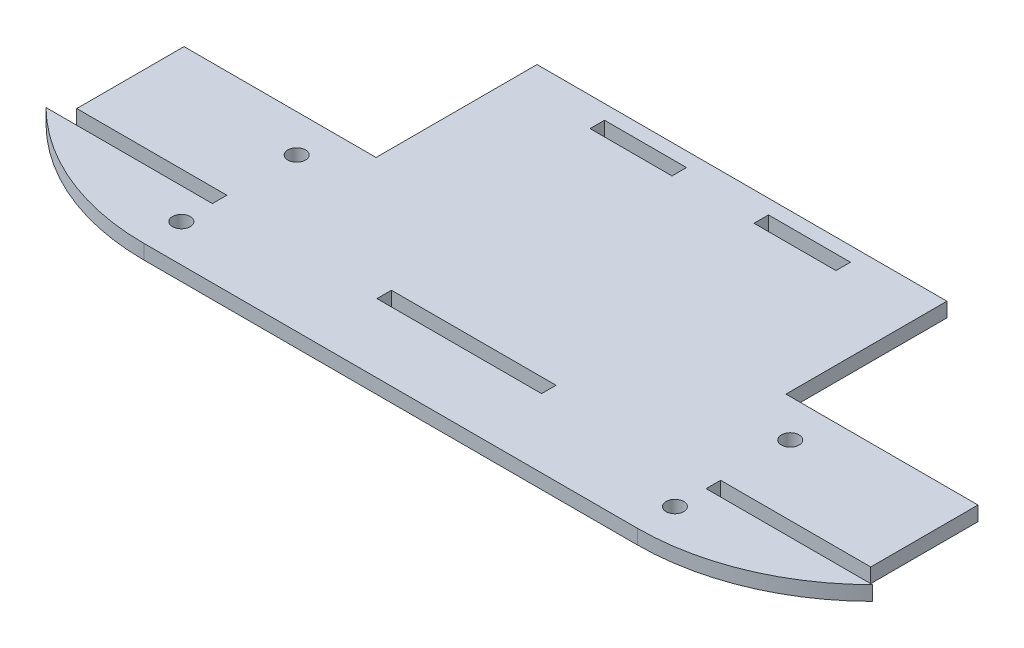
ISO-10303-21;
HEADER;
FILE_DESCRIPTION(('STEP AP214'),'2;1');
FILE_NAME('part.step','',(''),(''),'','','');
FILE_SCHEMA(('AUTOMOTIVE_DESIGN { 1 0 10303 214 1 1 1 1 }'));
ENDSEC;
DATA;
#1=APPLICATION_CONTEXT('core data for automotive mechanical design processes');
#2=APPLICATION_PROTOCOL_DEFINITION('international standard','automotive_design',2000,#1);
#3=PRODUCT_CONTEXT('',#1,'mechanical');
#4=PRODUCT('Part','Part','',(#3));
#5=PRODUCT_RELATED_PRODUCT_CATEGORY('part','',(#4));
#6=PRODUCT_DEFINITION_FORMATION('','',#4);
#7=PRODUCT_DEFINITION_CONTEXT('part definition',#1,'design');
#8=PRODUCT_DEFINITION('design','',#6,#7);
#9=PRODUCT_DEFINITION_SHAPE('','',#8);
#10=(LENGTH_UNIT() NAMED_UNIT(*) SI_UNIT(.MILLI.,.METRE.));
#11=(NAMED_UNIT(*) PLANE_ANGLE_UNIT() SI_UNIT($,.RADIAN.));
#12=(NAMED_UNIT(*) SI_UNIT($,.STERADIAN.) SOLID_ANGLE_UNIT());
#13=UNCERTAINTY_MEASURE_WITH_UNIT(LENGTH_MEASURE(1.E-05),#10,'distance_accuracy_value','');
#14=(GEOMETRIC_REPRESENTATION_CONTEXT(3) GLOBAL_UNCERTAINTY_ASSIGNED_CONTEXT((#13)) GLOBAL_UNIT_ASSIGNED_CONTEXT((#10,
#11,#12)) REPRESENTATION_CONTEXT('',''));
#15=CARTESIAN_POINT('',(0.,0.,0.));
#16=DIRECTION('',(0.,0.,1.));
#17=DIRECTION('',(1.,0.,0.));
#18=AXIS2_PLACEMENT_3D('',#15,#16,#17);
#19=CARTESIAN_POINT('',(-46.,2.7,-44.));
#20=DIRECTION('',(0.,1.,0.));
#21=DIRECTION('',(0.,0.,1.));
#22=AXIS2_PLACEMENT_3D('',#19,#20,#21);
#23=PLANE('',#22);
#24=CARTESIAN_POINT('',(-46.,2.7,-7.));
#25=DIRECTION('',(0.,1.,0.));
#26=DIRECTION('',(0.,0.,1.));
#27=AXIS2_PLACEMENT_3D('',#24,#25,#26);
#28=CIRCLE('',#27,1.65);
#29=CARTESIAN_POINT('',(-46.,2.7,-5.35));
#30=VERTEX_POINT('',#29);
#31=EDGE_CURVE('E291',#30,#30,#28,.T.);
#32=ORIENTED_EDGE('',*,*,#31,.F.);
#33=EDGE_LOOP('',(#32));
#34=FACE_BOUND('',#33,.T.);
#35=DIRECTION('',(0.,0.,1.));
#36=VECTOR('',#35,1.);
#37=CARTESIAN_POINT('',(-15.34,2.7,-15.5));
#38=LINE('',#37,#36);
#39=CARTESIAN_POINT('',(-15.34,2.7,-15.5));
#40=VERTEX_POINT('',#39);
#41=CARTESIAN_POINT('',(-15.34,2.7,-12.8));
#42=VERTEX_POINT('',#41);
#43=EDGE_CURVE('E305',#40,#42,#38,.T.);
#44=ORIENTED_EDGE('',*,*,#43,.F.);
#45=DIRECTION('',(-1.,0.,0.));
#46=VECTOR('',#45,1.);
#47=CARTESIAN_POINT('',(15.34,2.7,-15.5));
#48=LINE('',#47,#46);
#49=CARTESIAN_POINT('',(15.34,2.7,-15.5));
#50=VERTEX_POINT('',#49);
#51=EDGE_CURVE('E303',#50,#40,#48,.T.);
#52=ORIENTED_EDGE('',*,*,#51,.F.);
#53=DIRECTION('',(0.,0.,-1.));
#54=VECTOR('',#53,1.);
#55=CARTESIAN_POINT('',(15.34,2.7,-12.8));
#56=LINE('',#55,#54);
#57=CARTESIAN_POINT('',(15.34,2.7,-12.8));
#58=VERTEX_POINT('',#57);
#59=EDGE_CURVE('E311',#58,#50,#56,.T.);
#60=ORIENTED_EDGE('',*,*,#59,.F.);
#61=DIRECTION('',(1.,0.,0.));
#62=VECTOR('',#61,1.);
#63=CARTESIAN_POINT('',(-15.34,2.7,-12.8));
#64=LINE('',#63,#62);
#65=EDGE_CURVE('E308',#42,#58,#64,.T.);
#66=ORIENTED_EDGE('',*,*,#65,.F.);
#67=EDGE_LOOP('',(#44,#52,#60,#66));
#68=FACE_BOUND('',#67,.T.);
#69=CARTESIAN_POINT('',(46.,2.7,-28.5));
#70=DIRECTION('',(0.,1.,0.));
#71=DIRECTION('',(0.,0.,1.));
#72=AXIS2_PLACEMENT_3D('',#69,#70,#71);
#73=CIRCLE('',#72,1.65);
#74=CARTESIAN_POINT('',(46.,2.7,-26.85));
#75=VERTEX_POINT('',#74);
#76=EDGE_CURVE('E334',#75,#75,#73,.T.);
#77=ORIENTED_EDGE('',*,*,#76,.F.);
#78=EDGE_LOOP('',(#77));
#79=FACE_BOUND('',#78,.T.);
#80=DIRECTION('',(-1.,0.,0.));
#81=VECTOR('',#80,1.);
#82=CARTESIAN_POINT('',(-46.0151510874645,2.7,-12.8));
#83=LINE('',#82,#81);
#84=CARTESIAN_POINT('',(-46.0151510874645,2.7,-12.8));
#85=VERTEX_POINT('',#84);
#86=CARTESIAN_POINT('',(-77.0251510874645,2.7,-12.8));
#87=VERTEX_POINT('',#86);
#88=EDGE_CURVE('E340',#85,#87,#83,.T.);
#89=ORIENTED_EDGE('',*,*,#88,.T.);
#90=CARTESIAN_POINT('',(-46.,2.7,-44.));
#91=DIRECTION('',(0.,1.,0.));
#92=DIRECTION('',(0.,0.,1.));
#93=AXIS2_PLACEMENT_3D('',#90,#91,#92);
#94=CIRCLE('',#93,44.);
#95=CARTESIAN_POINT('',(-46.,2.7,0.));
#96=VERTEX_POINT('',#95);
#97=EDGE_CURVE('E343',#87,#96,#94,.T.);
#98=ORIENTED_EDGE('',*,*,#97,.T.);
#99=DIRECTION('',(1.,0.,0.));
#100=VECTOR('',#99,1.);
#101=CARTESIAN_POINT('',(-46.,2.7,0.));
#102=LINE('',#101,#100);
#103=CARTESIAN_POINT('',(46.,2.7,0.));
#104=VERTEX_POINT('',#103);
#105=EDGE_CURVE('E346',#96,#104,#102,.T.);
#106=ORIENTED_EDGE('',*,*,#105,.T.);
#107=CARTESIAN_POINT('',(46.,2.7,-44.));
#108=DIRECTION('',(0.,1.,0.));
#109=DIRECTION('',(0.,0.,1.));
#110=AXIS2_PLACEMENT_3D('',#107,#108,#109);
#111=CIRCLE('',#110,44.);
#112=CARTESIAN_POINT('',(77.0251510874645,2.7,-12.8));
#113=VERTEX_POINT('',#112);
#114=EDGE_CURVE('E348',#104,#113,#111,.T.);
#115=ORIENTED_EDGE('',*,*,#114,.T.);
#116=DIRECTION('',(-1.,0.,0.));
#117=VECTOR('',#116,1.);
#118=CARTESIAN_POINT('',(77.0251510874645,2.7,-12.8));
#119=LINE('',#118,#117);
#120=CARTESIAN_POINT('',(46.0151510874645,2.7,-12.8));
#121=VERTEX_POINT('',#120);
#122=EDGE_CURVE('E350',#113,#121,#119,.T.);
#123=ORIENTED_EDGE('',*,*,#122,.T.);
#124=DIRECTION('',(0.,0.,-1.));
#125=VECTOR('',#124,1.);
#126=CARTESIAN_POINT('',(46.0151510874645,2.7,-15.5));
#127=LINE('',#126,#125);
#128=CARTESIAN_POINT('',(46.0151510874645,2.7,-15.5));
#129=VERTEX_POINT('',#128);
#130=EDGE_CURVE('E352',#121,#129,#127,.T.);
#131=ORIENTED_EDGE('',*,*,#130,.T.);
#132=DIRECTION('',(1.,0.,0.));
#133=VECTOR('',#132,1.);
#134=CARTESIAN_POINT('',(46.0151510874645,2.7,-15.5));
#135=LINE('',#134,#133);
#136=CARTESIAN_POINT('',(73.9951510874645,2.7,-15.5));
#137=VERTEX_POINT('',#136);
#138=EDGE_CURVE('E354',#129,#137,#135,.T.);
#139=ORIENTED_EDGE('',*,*,#138,.T.);
#140=DIRECTION('',(0.,0.,-1.));
#141=VECTOR('',#140,1.);
#142=CARTESIAN_POINT('',(73.9951510874645,2.7,-35.5));
#143=LINE('',#142,#141);
#144=CARTESIAN_POINT('',(73.9951510874645,2.7,-35.5));
#145=VERTEX_POINT('',#144);
#146=EDGE_CURVE('E356',#137,#145,#143,.T.);
#147=ORIENTED_EDGE('',*,*,#146,.T.);
#148=DIRECTION('',(-1.,0.,0.));
#149=VECTOR('',#148,1.);
#150=CARTESIAN_POINT('',(73.9951510874645,2.7,-35.5));
#151=LINE('',#150,#149);
#152=CARTESIAN_POINT('',(38.2,2.7,-35.5));
#153=VERTEX_POINT('',#152);
#154=EDGE_CURVE('E358',#145,#153,#151,.T.);
#155=ORIENTED_EDGE('',*,*,#154,.T.);
#156=DIRECTION('',(0.,0.,-1.));
#157=VECTOR('',#156,1.);
#158=CARTESIAN_POINT('',(38.2,2.7,-35.5));
#159=LINE('',#158,#157);
#160=CARTESIAN_POINT('',(38.2,2.7,-65.5));
#161=VERTEX_POINT('',#160);
#162=EDGE_CURVE('E360',#153,#161,#159,.T.);
#163=ORIENTED_EDGE('',*,*,#162,.T.);
#164=DIRECTION('',(-1.,0.,0.));
#165=VECTOR('',#164,1.);
#166=CARTESIAN_POINT('',(-38.2,2.7,-65.5));
#167=LINE('',#166,#165);
#168=CARTESIAN_POINT('',(-38.2,2.7,-65.5));
#169=VERTEX_POINT('',#168);
#170=EDGE_CURVE('E362',#161,#169,#167,.T.);
#171=ORIENTED_EDGE('',*,*,#170,.T.);
#172=DIRECTION('',(0.,0.,1.));
#173=VECTOR('',#172,1.);
#174=CARTESIAN_POINT('',(-38.2,2.7,-65.5));
#175=LINE('',#174,#173);
#176=CARTESIAN_POINT('',(-38.2,2.7,-35.5));
#177=VERTEX_POINT('',#176);
#178=EDGE_CURVE('E364',#169,#177,#175,.T.);
#179=ORIENTED_EDGE('',*,*,#178,.T.);
#180=DIRECTION('',(-1.,0.,0.));
#181=VECTOR('',#180,1.);
#182=CARTESIAN_POINT('',(-73.9951510874645,2.7,-35.5));
#183=LINE('',#182,#181);
#184=CARTESIAN_POINT('',(-73.9951510874645,2.7,-35.5));
#185=VERTEX_POINT('',#184);
#186=EDGE_CURVE('E366',#177,#185,#183,.T.);
#187=ORIENTED_EDGE('',*,*,#186,.T.);
#188=DIRECTION('',(0.,0.,1.));
#189=VECTOR('',#188,1.);
#190=CARTESIAN_POINT('',(-73.9951510874645,2.7,-35.5));
#191=LINE('',#190,#189);
#192=CARTESIAN_POINT('',(-73.9951510874645,2.7,-15.5));
#193=VERTEX_POINT('',#192);
#194=EDGE_CURVE('E368',#185,#193,#191,.T.);
#195=ORIENTED_EDGE('',*,*,#194,.T.);
#196=DIRECTION('',(1.,0.,0.));
#197=VECTOR('',#196,1.);
#198=CARTESIAN_POINT('',(-46.0151510874645,2.7,-15.5));
#199=LINE('',#198,#197);
#200=CARTESIAN_POINT('',(-46.0151510874645,2.7,-15.5));
#201=VERTEX_POINT('',#200);
#202=EDGE_CURVE('E370',#193,#201,#199,.T.);
#203=ORIENTED_EDGE('',*,*,#202,.T.);
#204=DIRECTION('',(0.,0.,1.));
#205=VECTOR('',#204,1.);
#206=CARTESIAN_POINT('',(-46.0151510874645,2.7,-15.5));
#207=LINE('',#206,#205);
#208=EDGE_CURVE('E372',#201,#85,#207,.T.);
#209=ORIENTED_EDGE('',*,*,#208,.T.);
#210=EDGE_LOOP('',(#89,#98,#106,#115,#123,#131,#139,#147,#155,#163,#171,#179,#187,#195,#203,#209));
#211=FACE_BOUND('',#210,.T.);
#212=CARTESIAN_POINT('',(46.,2.7,-7.));
#213=DIRECTION('',(0.,1.,0.));
#214=DIRECTION('',(0.,0.,1.));
#215=AXIS2_PLACEMENT_3D('',#212,#213,#214);
#216=CIRCLE('',#215,1.65);
#217=CARTESIAN_POINT('',(46.,2.7,-5.35));
#218=VERTEX_POINT('',#217);
#219=EDGE_CURVE('E297',#218,#218,#216,.T.);
#220=ORIENTED_EDGE('',*,*,#219,.F.);
#221=EDGE_LOOP('',(#220));
#222=FACE_BOUND('',#221,.T.);
#223=CARTESIAN_POINT('',(-46.,2.7,-28.5));
#224=DIRECTION('',(0.,1.,0.));
#225=DIRECTION('',(0.,0.,1.));
#226=AXIS2_PLACEMENT_3D('',#223,#224,#225);
#227=CIRCLE('',#226,1.65);
#228=CARTESIAN_POINT('',(-46.,2.7,-26.85));
#229=VERTEX_POINT('',#228);
#230=EDGE_CURVE('E285',#229,#229,#227,.T.);
#231=ORIENTED_EDGE('',*,*,#230,.F.);
#232=EDGE_LOOP('',(#231));
#233=FACE_BOUND('',#232,.T.);
#234=DIRECTION('',(1.,0.,0.));
#235=VECTOR('',#234,1.);
#236=CARTESIAN_POINT('',(-7.63999999999999,2.7,-60.1));
#237=LINE('',#236,#235);
#238=CARTESIAN_POINT('',(-22.92,2.7,-60.1));
#239=VERTEX_POINT('',#238);
#240=CARTESIAN_POINT('',(-7.63999999999999,2.7,-60.1));
#241=VERTEX_POINT('',#240);
#242=EDGE_CURVE('E256',#239,#241,#237,.T.);
#243=ORIENTED_EDGE('',*,*,#242,.F.);
#244=DIRECTION('',(0.,0.,1.));
#245=VECTOR('',#244,1.);
#246=CARTESIAN_POINT('',(-22.92,2.7,-62.8));
#247=LINE('',#246,#245);
#248=CARTESIAN_POINT('',(-22.92,2.7,-62.8));
#249=VERTEX_POINT('',#248);
#250=EDGE_CURVE('E254',#249,#239,#247,.T.);
#251=ORIENTED_EDGE('',*,*,#250,.F.);
#252=DIRECTION('',(-1.,0.,0.));
#253=VECTOR('',#252,1.);
#254=CARTESIAN_POINT('',(-22.92,2.7,-62.8));
#255=LINE('',#254,#253);
#256=CARTESIAN_POINT('',(-7.64000000000001,2.7,-62.8));
#257=VERTEX_POINT('',#256);
#258=EDGE_CURVE('E262',#257,#249,#255,.T.);
#259=ORIENTED_EDGE('',*,*,#258,.F.);
#260=DIRECTION('',(0.,0.,-1.));
#261=VECTOR('',#260,1.);
#262=CARTESIAN_POINT('',(-7.64000000000001,2.7,-62.8));
#263=LINE('',#262,#261);
#264=EDGE_CURVE('E259',#241,#257,#263,.T.);
#265=ORIENTED_EDGE('',*,*,#264,.F.);
#266=EDGE_LOOP('',(#243,#251,#259,#265));
#267=FACE_BOUND('',#266,.T.);
#268=DIRECTION('',(1.,0.,0.));
#269=VECTOR('',#268,1.);
#270=CARTESIAN_POINT('',(22.92,2.7,-60.1));
#271=LINE('',#270,#269);
#272=CARTESIAN_POINT('',(7.64000000000001,2.7,-60.1));
#273=VERTEX_POINT('',#272);
#274=CARTESIAN_POINT('',(22.92,2.7,-60.1));
#275=VERTEX_POINT('',#274);
#276=EDGE_CURVE('E226',#273,#275,#271,.T.);
#277=ORIENTED_EDGE('',*,*,#276,.F.);
#278=DIRECTION('',(0.,0.,1.));
#279=VECTOR('',#278,1.);
#280=CARTESIAN_POINT('',(7.63999999999999,2.7,-62.8));
#281=LINE('',#280,#279);
#282=CARTESIAN_POINT('',(7.63999999999999,2.7,-62.8));
#283=VERTEX_POINT('',#282);
#284=EDGE_CURVE('E218',#283,#273,#281,.T.);
#285=ORIENTED_EDGE('',*,*,#284,.F.);
#286=DIRECTION('',(-1.,0.,0.));
#287=VECTOR('',#286,1.);
#288=CARTESIAN_POINT('',(7.63999999999999,2.7,-62.8));
#289=LINE('',#288,#287);
#290=CARTESIAN_POINT('',(22.92,2.7,-62.8));
#291=VERTEX_POINT('',#290);
#292=EDGE_CURVE('E240',#291,#283,#289,.T.);
#293=ORIENTED_EDGE('',*,*,#292,.F.);
#294=DIRECTION('',(0.,0.,-1.));
#295=VECTOR('',#294,1.);
#296=CARTESIAN_POINT('',(22.92,2.7,-62.8));
#297=LINE('',#296,#295);
#298=EDGE_CURVE('E238',#275,#291,#297,.T.);
#299=ORIENTED_EDGE('',*,*,#298,.F.);
#300=EDGE_LOOP('',(#277,#285,#293,#299));
#301=FACE_BOUND('',#300,.T.);
#302=ADVANCED_FACE('F33',(#34,#68,#79,#211,#222,#233,#267,#301),#23,.T.);
#303=CARTESIAN_POINT('',(-46.,0.,-44.));
#304=DIRECTION('',(0.,1.,0.));
#305=DIRECTION('',(0.,0.,1.));
#306=AXIS2_PLACEMENT_3D('',#303,#304,#305);
#307=PLANE('',#306);
#308=DIRECTION('',(0.,0.,1.));
#309=VECTOR('',#308,1.);
#310=CARTESIAN_POINT('',(-22.92,0.,-62.8));
#311=LINE('',#310,#309);
#312=CARTESIAN_POINT('',(-22.92,0.,-62.8));
#313=VERTEX_POINT('',#312);
#314=CARTESIAN_POINT('',(-22.92,0.,-60.1));
#315=VERTEX_POINT('',#314);
#316=EDGE_CURVE('E234',#313,#315,#311,.T.);
#317=ORIENTED_EDGE('',*,*,#316,.T.);
#318=DIRECTION('',(1.,0.,0.));
#319=VECTOR('',#318,1.);
#320=CARTESIAN_POINT('',(-7.63999999999999,0.,-60.1));
#321=LINE('',#320,#319);
#322=CARTESIAN_POINT('',(-7.63999999999999,0.,-60.1));
#323=VERTEX_POINT('',#322);
#324=EDGE_CURVE('E267',#315,#323,#321,.T.);
#325=ORIENTED_EDGE('',*,*,#324,.T.);
#326=DIRECTION('',(0.,0.,-1.));
#327=VECTOR('',#326,1.);
#328=CARTESIAN_POINT('',(-7.64000000000001,0.,-62.8));
#329=LINE('',#328,#327);
#330=CARTESIAN_POINT('',(-7.64000000000001,0.,-62.8));
#331=VERTEX_POINT('',#330);
#332=EDGE_CURVE('E270',#323,#331,#329,.T.);
#333=ORIENTED_EDGE('',*,*,#332,.T.);
#334=DIRECTION('',(-1.,0.,0.));
#335=VECTOR('',#334,1.);
#336=CARTESIAN_POINT('',(-22.92,0.,-62.8));
#337=LINE('',#336,#335);
#338=EDGE_CURVE('E257',#331,#313,#337,.T.);
#339=ORIENTED_EDGE('',*,*,#338,.T.);
#340=EDGE_LOOP('',(#317,#325,#333,#339));
#341=FACE_BOUND('',#340,.T.);
#342=CARTESIAN_POINT('',(46.,0.,-28.5));
#343=DIRECTION('',(0.,1.,0.));
#344=DIRECTION('',(0.,0.,1.));
#345=AXIS2_PLACEMENT_3D('',#342,#343,#344);
#346=CIRCLE('',#345,1.65);
#347=CARTESIAN_POINT('',(46.,0.,-26.85));
#348=VERTEX_POINT('',#347);
#349=EDGE_CURVE('E333',#348,#348,#346,.T.);
#350=ORIENTED_EDGE('',*,*,#349,.T.);
#351=EDGE_LOOP('',(#350));
#352=FACE_BOUND('',#351,.T.);
#353=DIRECTION('',(-1.,0.,0.));
#354=VECTOR('',#353,1.);
#355=CARTESIAN_POINT('',(-46.0151510874645,0.,-12.8));
#356=LINE('',#355,#354);
#357=CARTESIAN_POINT('',(-46.0151510874645,0.,-12.8));
#358=VERTEX_POINT('',#357);
#359=CARTESIAN_POINT('',(-77.0251510874645,0.,-12.8));
#360=VERTEX_POINT('',#359);
#361=EDGE_CURVE('E337',#358,#360,#356,.T.);
#362=ORIENTED_EDGE('',*,*,#361,.F.);
#363=DIRECTION('',(0.,0.,1.));
#364=VECTOR('',#363,1.);
#365=CARTESIAN_POINT('',(-46.0151510874645,0.,-15.5));
#366=LINE('',#365,#364);
#367=CARTESIAN_POINT('',(-46.0151510874645,0.,-15.5));
#368=VERTEX_POINT('',#367);
#369=EDGE_CURVE('E344',#368,#358,#366,.T.);
#370=ORIENTED_EDGE('',*,*,#369,.F.);
#371=DIRECTION('',(1.,0.,0.));
#372=VECTOR('',#371,1.);
#373=CARTESIAN_POINT('',(-46.0151510874645,0.,-15.5));
#374=LINE('',#373,#372);
#375=CARTESIAN_POINT('',(-73.9951510874645,0.,-15.5));
#376=VERTEX_POINT('',#375);
#377=EDGE_CURVE('E403',#376,#368,#374,.T.);
#378=ORIENTED_EDGE('',*,*,#377,.F.);
#379=DIRECTION('',(0.,0.,1.));
#380=VECTOR('',#379,1.);
#381=CARTESIAN_POINT('',(-73.9951510874645,0.,-35.5));
#382=LINE('',#381,#380);
#383=CARTESIAN_POINT('',(-73.9951510874645,0.,-35.5));
#384=VERTEX_POINT('',#383);
#385=EDGE_CURVE('E401',#384,#376,#382,.T.);
#386=ORIENTED_EDGE('',*,*,#385,.F.);
#387=DIRECTION('',(-1.,0.,0.));
#388=VECTOR('',#387,1.);
#389=CARTESIAN_POINT('',(-73.9951510874645,0.,-35.5));
#390=LINE('',#389,#388);
#391=CARTESIAN_POINT('',(-38.2,0.,-35.5));
#392=VERTEX_POINT('',#391);
#393=EDGE_CURVE('E399',#392,#384,#390,.T.);
#394=ORIENTED_EDGE('',*,*,#393,.F.);
#395=DIRECTION('',(0.,0.,1.));
#396=VECTOR('',#395,1.);
#397=CARTESIAN_POINT('',(-38.2,0.,-65.5));
#398=LINE('',#397,#396);
#399=CARTESIAN_POINT('',(-38.2,0.,-65.5));
#400=VERTEX_POINT('',#399);
#401=EDGE_CURVE('E397',#400,#392,#398,.T.);
#402=ORIENTED_EDGE('',*,*,#401,.F.);
#403=DIRECTION('',(-1.,0.,0.));
#404=VECTOR('',#403,1.);
#405=CARTESIAN_POINT('',(-38.2,0.,-65.5));
#406=LINE('',#405,#404);
#407=CARTESIAN_POINT('',(38.2,0.,-65.5));
#408=VERTEX_POINT('',#407);
#409=EDGE_CURVE('E395',#408,#400,#406,.T.);
#410=ORIENTED_EDGE('',*,*,#409,.F.);
#411=DIRECTION('',(0.,0.,-1.));
#412=VECTOR('',#411,1.);
#413=CARTESIAN_POINT('',(38.2,0.,-35.5));
#414=LINE('',#413,#412);
#415=CARTESIAN_POINT('',(38.2,0.,-35.5));
#416=VERTEX_POINT('',#415);
#417=EDGE_CURVE('E393',#416,#408,#414,.T.);
#418=ORIENTED_EDGE('',*,*,#417,.F.);
#419=DIRECTION('',(-1.,0.,0.));
#420=VECTOR('',#419,1.);
#421=CARTESIAN_POINT('',(73.9951510874645,0.,-35.5));
#422=LINE('',#421,#420);
#423=CARTESIAN_POINT('',(73.9951510874645,0.,-35.5));
#424=VERTEX_POINT('',#423);
#425=EDGE_CURVE('E391',#424,#416,#422,.T.);
#426=ORIENTED_EDGE('',*,*,#425,.F.);
#427=DIRECTION('',(0.,0.,-1.));
#428=VECTOR('',#427,1.);
#429=CARTESIAN_POINT('',(73.9951510874645,0.,-35.5));
#430=LINE('',#429,#428);
#431=CARTESIAN_POINT('',(73.9951510874645,0.,-15.5));
#432=VERTEX_POINT('',#431);
#433=EDGE_CURVE('E389',#432,#424,#430,.T.);
#434=ORIENTED_EDGE('',*,*,#433,.F.);
#435=DIRECTION('',(1.,0.,0.));
#436=VECTOR('',#435,1.);
#437=CARTESIAN_POINT('',(46.0151510874645,0.,-15.5));
#438=LINE('',#437,#436);
#439=CARTESIAN_POINT('',(46.0151510874645,0.,-15.5));
#440=VERTEX_POINT('',#439);
#441=EDGE_CURVE('E387',#440,#432,#438,.T.);
#442=ORIENTED_EDGE('',*,*,#441,.F.);
#443=DIRECTION('',(0.,0.,-1.));
#444=VECTOR('',#443,1.);
#445=CARTESIAN_POINT('',(46.0151510874645,0.,-15.5));
#446=LINE('',#445,#444);
#447=CARTESIAN_POINT('',(46.0151510874645,0.,-12.8));
#448=VERTEX_POINT('',#447);
#449=EDGE_CURVE('E385',#448,#440,#446,.T.);
#450=ORIENTED_EDGE('',*,*,#449,.F.);
#451=DIRECTION('',(-1.,0.,0.));
#452=VECTOR('',#451,1.);
#453=CARTESIAN_POINT('',(77.0251510874645,0.,-12.8));
#454=LINE('',#453,#452);
#455=CARTESIAN_POINT('',(77.0251510874645,0.,-12.8));
#456=VERTEX_POINT('',#455);
#457=EDGE_CURVE('E383',#456,#448,#454,.T.);
#458=ORIENTED_EDGE('',*,*,#457,.F.);
#459=CARTESIAN_POINT('',(46.,0.,-44.));
#460=DIRECTION('',(0.,1.,0.));
#461=DIRECTION('',(0.,0.,1.));
#462=AXIS2_PLACEMENT_3D('',#459,#460,#461);
#463=CIRCLE('',#462,44.);
#464=CARTESIAN_POINT('',(46.,0.,0.));
#465=VERTEX_POINT('',#464);
#466=EDGE_CURVE('E381',#465,#456,#463,.T.);
#467=ORIENTED_EDGE('',*,*,#466,.F.);
#468=DIRECTION('',(1.,0.,0.));
#469=VECTOR('',#468,1.);
#470=CARTESIAN_POINT('',(-46.,0.,0.));
#471=LINE('',#470,#469);
#472=CARTESIAN_POINT('',(-46.,0.,0.));
#473=VERTEX_POINT('',#472);
#474=EDGE_CURVE('E379',#473,#465,#471,.T.);
#475=ORIENTED_EDGE('',*,*,#474,.F.);
#476=CARTESIAN_POINT('',(-46.,0.,-44.));
#477=DIRECTION('',(0.,1.,0.));
#478=DIRECTION('',(0.,0.,1.));
#479=AXIS2_PLACEMENT_3D('',#476,#477,#478);
#480=CIRCLE('',#479,44.);
#481=EDGE_CURVE('E377',#360,#473,#480,.T.);
#482=ORIENTED_EDGE('',*,*,#481,.F.);
#483=EDGE_LOOP('',(#362,#370,#378,#386,#394,#402,#410,#418,#426,#434,#442,#450,#458,#467,#475,#482));
#484=FACE_BOUND('',#483,.T.);
#485=DIRECTION('',(-1.,0.,0.));
#486=VECTOR('',#485,1.);
#487=CARTESIAN_POINT('',(15.34,0.,-15.5));
#488=LINE('',#487,#486);
#489=CARTESIAN_POINT('',(15.34,0.,-15.5));
#490=VERTEX_POINT('',#489);
#491=CARTESIAN_POINT('',(-15.34,0.,-15.5));
#492=VERTEX_POINT('',#491);
#493=EDGE_CURVE('E300',#490,#492,#488,.T.);
#494=ORIENTED_EDGE('',*,*,#493,.T.);
#495=DIRECTION('',(0.,0.,1.));
#496=VECTOR('',#495,1.);
#497=CARTESIAN_POINT('',(-15.34,0.,-15.5));
#498=LINE('',#497,#496);
#499=CARTESIAN_POINT('',(-15.34,0.,-12.8));
#500=VERTEX_POINT('',#499);
#501=EDGE_CURVE('E316',#492,#500,#498,.T.);
#502=ORIENTED_EDGE('',*,*,#501,.T.);
#503=DIRECTION('',(1.,0.,0.));
#504=VECTOR('',#503,1.);
#505=CARTESIAN_POINT('',(-15.34,0.,-12.8));
#506=LINE('',#505,#504);
#507=CARTESIAN_POINT('',(15.34,0.,-12.8));
#508=VERTEX_POINT('',#507);
#509=EDGE_CURVE('E319',#500,#508,#506,.T.);
#510=ORIENTED_EDGE('',*,*,#509,.T.);
#511=DIRECTION('',(0.,0.,-1.));
#512=VECTOR('',#511,1.);
#513=CARTESIAN_POINT('',(15.34,0.,-12.8));
#514=LINE('',#513,#512);
#515=EDGE_CURVE('E306',#508,#490,#514,.T.);
#516=ORIENTED_EDGE('',*,*,#515,.T.);
#517=EDGE_LOOP('',(#494,#502,#510,#516));
#518=FACE_BOUND('',#517,.T.);
#519=CARTESIAN_POINT('',(46.,0.,-7.));
#520=DIRECTION('',(0.,1.,0.));
#521=DIRECTION('',(0.,0.,1.));
#522=AXIS2_PLACEMENT_3D('',#519,#520,#521);
#523=CIRCLE('',#522,1.65);
#524=CARTESIAN_POINT('',(46.,0.,-5.35));
#525=VERTEX_POINT('',#524);
#526=EDGE_CURVE('E294',#525,#525,#523,.T.);
#527=ORIENTED_EDGE('',*,*,#526,.T.);
#528=EDGE_LOOP('',(#527));
#529=FACE_BOUND('',#528,.T.);
#530=CARTESIAN_POINT('',(-46.,0.,-7.));
#531=DIRECTION('',(0.,1.,0.));
#532=DIRECTION('',(0.,0.,1.));
#533=AXIS2_PLACEMENT_3D('',#530,#531,#532);
#534=CIRCLE('',#533,1.65);
#535=CARTESIAN_POINT('',(-46.,0.,-5.35));
#536=VERTEX_POINT('',#535);
#537=EDGE_CURVE('E288',#536,#536,#534,.T.);
#538=ORIENTED_EDGE('',*,*,#537,.T.);
#539=EDGE_LOOP('',(#538));
#540=FACE_BOUND('',#539,.T.);
#541=CARTESIAN_POINT('',(-46.,0.,-28.5));
#542=DIRECTION('',(0.,1.,0.));
#543=DIRECTION('',(0.,0.,1.));
#544=AXIS2_PLACEMENT_3D('',#541,#542,#543);
#545=CIRCLE('',#544,1.65);
#546=CARTESIAN_POINT('',(-46.,0.,-26.85));
#547=VERTEX_POINT('',#546);
#548=EDGE_CURVE('E284',#547,#547,#545,.T.);
#549=ORIENTED_EDGE('',*,*,#548,.T.);
#550=EDGE_LOOP('',(#549));
#551=FACE_BOUND('',#550,.T.);
#552=DIRECTION('',(0.,0.,1.));
#553=VECTOR('',#552,1.);
#554=CARTESIAN_POINT('',(7.63999999999999,0.,-62.8));
#555=LINE('',#554,#553);
#556=CARTESIAN_POINT('',(7.63999999999999,0.,-62.8));
#557=VERTEX_POINT('',#556);
#558=CARTESIAN_POINT('',(7.64000000000001,0.,-60.1));
#559=VERTEX_POINT('',#558);
#560=EDGE_CURVE('E56',#557,#559,#555,.T.);
#561=ORIENTED_EDGE('',*,*,#560,.T.);
#562=DIRECTION('',(1.,0.,0.));
#563=VECTOR('',#562,1.);
#564=CARTESIAN_POINT('',(22.92,0.,-60.1));
#565=LINE('',#564,#563);
#566=CARTESIAN_POINT('',(22.92,0.,-60.1));
#567=VERTEX_POINT('',#566);
#568=EDGE_CURVE('E233',#559,#567,#565,.T.);
#569=ORIENTED_EDGE('',*,*,#568,.T.);
#570=DIRECTION('',(0.,0.,-1.));
#571=VECTOR('',#570,1.);
#572=CARTESIAN_POINT('',(22.92,0.,-62.8));
#573=LINE('',#572,#571);
#574=CARTESIAN_POINT('',(22.92,0.,-62.8));
#575=VERTEX_POINT('',#574);
#576=EDGE_CURVE('E246',#567,#575,#573,.T.);
#577=ORIENTED_EDGE('',*,*,#576,.T.);
#578=DIRECTION('',(-1.,0.,0.));
#579=VECTOR('',#578,1.);
#580=CARTESIAN_POINT('',(7.63999999999999,0.,-62.8));
#581=LINE('',#580,#579);
#582=EDGE_CURVE('E227',#575,#557,#581,.T.);
#583=ORIENTED_EDGE('',*,*,#582,.T.);
#584=EDGE_LOOP('',(#561,#569,#577,#583));
#585=FACE_BOUND('',#584,.T.);
#586=ADVANCED_FACE('F457',(#341,#352,#484,#518,#529,#540,#551,#585),#307,.F.);
#587=CARTESIAN_POINT('',(-46.0151510874645,2.7,-12.8));
#588=DIRECTION('',(0.,0.,1.));
#589=DIRECTION('',(1.,0.,0.));
#590=AXIS2_PLACEMENT_3D('',#587,#588,#589);
#591=PLANE('',#590);
#592=ORIENTED_EDGE('',*,*,#361,.T.);
#593=DIRECTION('',(0.,-1.,0.));
#594=VECTOR('',#593,1.);
#595=CARTESIAN_POINT('',(-77.0251510874645,2.7,-12.8));
#596=LINE('',#595,#594);
#597=EDGE_CURVE('E11',#87,#360,#596,.T.);
#598=ORIENTED_EDGE('',*,*,#597,.F.);
#599=ORIENTED_EDGE('',*,*,#88,.F.);
#600=DIRECTION('',(0.,-1.,0.));
#601=VECTOR('',#600,1.);
#602=CARTESIAN_POINT('',(-46.0151510874645,2.7,-12.8));
#603=LINE('',#602,#601);
#604=EDGE_CURVE('E374',#85,#358,#603,.T.);
#605=ORIENTED_EDGE('',*,*,#604,.T.);
#606=EDGE_LOOP('',(#592,#598,#599,#605));
#607=FACE_BOUND('',#606,.T.);
#608=ADVANCED_FACE('F35',(#607),#591,.F.);
#609=CARTESIAN_POINT('',(-46.,2.7,-44.));
#610=DIRECTION('',(0.,-1.,0.));
#611=DIRECTION('',(0.,0.,-1.));
#612=AXIS2_PLACEMENT_3D('',#609,#610,#611);
#613=CYLINDRICAL_SURFACE('',#612,44.);
#614=ORIENTED_EDGE('',*,*,#481,.T.);
#615=DIRECTION('',(0.,-1.,0.));
#616=VECTOR('',#615,1.);
#617=CARTESIAN_POINT('',(-46.,2.7,0.));
#618=LINE('',#617,#616);
#619=EDGE_CURVE('E41',#96,#473,#618,.T.);
#620=ORIENTED_EDGE('',*,*,#619,.F.);
#621=ORIENTED_EDGE('',*,*,#97,.F.);
#622=ORIENTED_EDGE('',*,*,#597,.T.);
#623=EDGE_LOOP('',(#614,#620,#621,#622));
#624=FACE_BOUND('',#623,.T.);
#625=ADVANCED_FACE('F475',(#624),#613,.T.);
#626=CARTESIAN_POINT('',(-46.,2.7,0.));
#627=DIRECTION('',(0.,0.,-1.));
#628=DIRECTION('',(-1.,0.,0.));
#629=AXIS2_PLACEMENT_3D('',#626,#627,#628);
#630=PLANE('',#629);
#631=ORIENTED_EDGE('',*,*,#474,.T.);
#632=DIRECTION('',(0.,-1.,0.));
#633=VECTOR('',#632,1.);
#634=CARTESIAN_POINT('',(46.,2.7,0.));
#635=LINE('',#634,#633);
#636=EDGE_CURVE('E444',#104,#465,#635,.T.);
#637=ORIENTED_EDGE('',*,*,#636,.F.);
#638=ORIENTED_EDGE('',*,*,#105,.F.);
#639=ORIENTED_EDGE('',*,*,#619,.T.);
#640=EDGE_LOOP('',(#631,#637,#638,#639));
#641=FACE_BOUND('',#640,.T.);
#642=ADVANCED_FACE('F451',(#641),#630,.F.);
#643=CARTESIAN_POINT('',(46.,2.7,-44.));
#644=DIRECTION('',(0.,-1.,0.));
#645=DIRECTION('',(0.,0.,-1.));
#646=AXIS2_PLACEMENT_3D('',#643,#644,#645);
#647=CYLINDRICAL_SURFACE('',#646,44.);
#648=ORIENTED_EDGE('',*,*,#466,.T.);
#649=DIRECTION('',(0.,-1.,0.));
#650=VECTOR('',#649,1.);
#651=CARTESIAN_POINT('',(77.0251510874645,2.7,-12.8));
#652=LINE('',#651,#650);
#653=EDGE_CURVE('E441',#113,#456,#652,.T.);
#654=ORIENTED_EDGE('',*,*,#653,.F.);
#655=ORIENTED_EDGE('',*,*,#114,.F.);
#656=ORIENTED_EDGE('',*,*,#636,.T.);
#657=EDGE_LOOP('',(#648,#654,#655,#656));
#658=FACE_BOUND('',#657,.T.);
#659=ADVANCED_FACE('F463',(#658),#647,.T.);
#660=CARTESIAN_POINT('',(77.0251510874645,2.7,-12.8));
#661=DIRECTION('',(0.,0.,1.));
#662=DIRECTION('',(1.,0.,0.));
#663=AXIS2_PLACEMENT_3D('',#660,#661,#662);
#664=PLANE('',#663);
#665=ORIENTED_EDGE('',*,*,#457,.T.);
#666=DIRECTION('',(0.,-1.,0.));
#667=VECTOR('',#666,1.);
#668=CARTESIAN_POINT('',(46.0151510874645,2.7,-12.8));
#669=LINE('',#668,#667);
#670=EDGE_CURVE('E438',#121,#448,#669,.T.);
#671=ORIENTED_EDGE('',*,*,#670,.F.);
#672=ORIENTED_EDGE('',*,*,#122,.F.);
#673=ORIENTED_EDGE('',*,*,#653,.T.);
#674=EDGE_LOOP('',(#665,#671,#672,#673));
#675=FACE_BOUND('',#674,.T.);
#676=ADVANCED_FACE('F467',(#675),#664,.F.);
#677=CARTESIAN_POINT('',(46.0151510874645,2.7,-15.5));
#678=DIRECTION('',(-1.,0.,0.));
#679=DIRECTION('',(0.,0.,1.));
#680=AXIS2_PLACEMENT_3D('',#677,#678,#679);
#681=PLANE('',#680);
#682=ORIENTED_EDGE('',*,*,#449,.T.);
#683=DIRECTION('',(0.,-1.,0.));
#684=VECTOR('',#683,1.);
#685=CARTESIAN_POINT('',(46.0151510874645,2.7,-15.5));
#686=LINE('',#685,#684);
#687=EDGE_CURVE('E435',#129,#440,#686,.T.);
#688=ORIENTED_EDGE('',*,*,#687,.F.);
#689=ORIENTED_EDGE('',*,*,#130,.F.);
#690=ORIENTED_EDGE('',*,*,#670,.T.);
#691=EDGE_LOOP('',(#682,#688,#689,#690));
#692=FACE_BOUND('',#691,.T.);
#693=ADVANCED_FACE('F528',(#692),#681,.F.);
#694=CARTESIAN_POINT('',(46.0151510874645,2.7,-15.5));
#695=DIRECTION('',(0.,0.,-1.));
#696=DIRECTION('',(-1.,0.,0.));
#697=AXIS2_PLACEMENT_3D('',#694,#695,#696);
#698=PLANE('',#697);
#699=ORIENTED_EDGE('',*,*,#441,.T.);
#700=DIRECTION('',(0.,-1.,0.));
#701=VECTOR('',#700,1.);
#702=CARTESIAN_POINT('',(73.9951510874645,2.7,-15.5));
#703=LINE('',#702,#701);
#704=EDGE_CURVE('E432',#137,#432,#703,.T.);
#705=ORIENTED_EDGE('',*,*,#704,.F.);
#706=ORIENTED_EDGE('',*,*,#138,.F.);
#707=ORIENTED_EDGE('',*,*,#687,.T.);
#708=EDGE_LOOP('',(#699,#705,#706,#707));
#709=FACE_BOUND('',#708,.T.);
#710=ADVANCED_FACE('F525',(#709),#698,.F.);
#711=CARTESIAN_POINT('',(73.9951510874645,2.7,-35.5));
#712=DIRECTION('',(-1.,0.,0.));
#713=DIRECTION('',(0.,0.,1.));
#714=AXIS2_PLACEMENT_3D('',#711,#712,#713);
#715=PLANE('',#714);
#716=ORIENTED_EDGE('',*,*,#433,.T.);
#717=DIRECTION('',(0.,-1.,0.));
#718=VECTOR('',#717,1.);
#719=CARTESIAN_POINT('',(73.9951510874645,2.7,-35.5));
#720=LINE('',#719,#718);
#721=EDGE_CURVE('E429',#145,#424,#720,.T.);
#722=ORIENTED_EDGE('',*,*,#721,.F.);
#723=ORIENTED_EDGE('',*,*,#146,.F.);
#724=ORIENTED_EDGE('',*,*,#704,.T.);
#725=EDGE_LOOP('',(#716,#722,#723,#724));
#726=FACE_BOUND('',#725,.T.);
#727=ADVANCED_FACE('F521',(#726),#715,.F.);
#728=CARTESIAN_POINT('',(73.9951510874645,2.7,-35.5));
#729=DIRECTION('',(0.,0.,1.));
#730=DIRECTION('',(1.,0.,0.));
#731=AXIS2_PLACEMENT_3D('',#728,#729,#730);
#732=PLANE('',#731);
#733=ORIENTED_EDGE('',*,*,#425,.T.);
#734=DIRECTION('',(0.,-1.,0.));
#735=VECTOR('',#734,1.);
#736=CARTESIAN_POINT('',(38.2,2.7,-35.5));
#737=LINE('',#736,#735);
#738=EDGE_CURVE('E426',#153,#416,#737,.T.);
#739=ORIENTED_EDGE('',*,*,#738,.F.);
#740=ORIENTED_EDGE('',*,*,#154,.F.);
#741=ORIENTED_EDGE('',*,*,#721,.T.);
#742=EDGE_LOOP('',(#733,#739,#740,#741));
#743=FACE_BOUND('',#742,.T.);
#744=ADVANCED_FACE('F517',(#743),#732,.F.);
#745=CARTESIAN_POINT('',(38.2,2.7,-35.5));
#746=DIRECTION('',(-1.,0.,0.));
#747=DIRECTION('',(0.,0.,1.));
#748=AXIS2_PLACEMENT_3D('',#745,#746,#747);
#749=PLANE('',#748);
#750=ORIENTED_EDGE('',*,*,#417,.T.);
#751=DIRECTION('',(0.,-1.,0.));
#752=VECTOR('',#751,1.);
#753=CARTESIAN_POINT('',(38.2,2.7,-65.5));
#754=LINE('',#753,#752);
#755=EDGE_CURVE('E423',#161,#408,#754,.T.);
#756=ORIENTED_EDGE('',*,*,#755,.F.);
#757=ORIENTED_EDGE('',*,*,#162,.F.);
#758=ORIENTED_EDGE('',*,*,#738,.T.);
#759=EDGE_LOOP('',(#750,#756,#757,#758));
#760=FACE_BOUND('',#759,.T.);
#761=ADVANCED_FACE('F512',(#760),#749,.F.);
#762=CARTESIAN_POINT('',(-38.2,2.7,-65.5));
#763=DIRECTION('',(0.,0.,1.));
#764=DIRECTION('',(1.,0.,0.));
#765=AXIS2_PLACEMENT_3D('',#762,#763,#764);
#766=PLANE('',#765);
#767=ORIENTED_EDGE('',*,*,#409,.T.);
#768=DIRECTION('',(0.,-1.,0.));
#769=VECTOR('',#768,1.);
#770=CARTESIAN_POINT('',(-38.2,2.7,-65.5));
#771=LINE('',#770,#769);
#772=EDGE_CURVE('E420',#169,#400,#771,.T.);
#773=ORIENTED_EDGE('',*,*,#772,.F.);
#774=ORIENTED_EDGE('',*,*,#170,.F.);
#775=ORIENTED_EDGE('',*,*,#755,.T.);
#776=EDGE_LOOP('',(#767,#773,#774,#775));
#777=FACE_BOUND('',#776,.T.);
#778=ADVANCED_FACE('F506',(#777),#766,.F.);
#779=CARTESIAN_POINT('',(-38.2,2.7,-65.5));
#780=DIRECTION('',(1.,0.,0.));
#781=DIRECTION('',(0.,0.,-1.));
#782=AXIS2_PLACEMENT_3D('',#779,#780,#781);
#783=PLANE('',#782);
#784=ORIENTED_EDGE('',*,*,#401,.T.);
#785=DIRECTION('',(0.,-1.,0.));
#786=VECTOR('',#785,1.);
#787=CARTESIAN_POINT('',(-38.2,2.7,-35.5));
#788=LINE('',#787,#786);
#789=EDGE_CURVE('E417',#177,#392,#788,.T.);
#790=ORIENTED_EDGE('',*,*,#789,.F.);
#791=ORIENTED_EDGE('',*,*,#178,.F.);
#792=ORIENTED_EDGE('',*,*,#772,.T.);
#793=EDGE_LOOP('',(#784,#790,#791,#792));
#794=FACE_BOUND('',#793,.T.);
#795=ADVANCED_FACE('F502',(#794),#783,.F.);
#796=CARTESIAN_POINT('',(-73.9951510874645,2.7,-35.5));
#797=DIRECTION('',(0.,0.,1.));
#798=DIRECTION('',(1.,0.,0.));
#799=AXIS2_PLACEMENT_3D('',#796,#797,#798);
#800=PLANE('',#799);
#801=ORIENTED_EDGE('',*,*,#393,.T.);
#802=DIRECTION('',(0.,-1.,0.));
#803=VECTOR('',#802,1.);
#804=CARTESIAN_POINT('',(-73.9951510874645,2.7,-35.5));
#805=LINE('',#804,#803);
#806=EDGE_CURVE('E414',#185,#384,#805,.T.);
#807=ORIENTED_EDGE('',*,*,#806,.F.);
#808=ORIENTED_EDGE('',*,*,#186,.F.);
#809=ORIENTED_EDGE('',*,*,#789,.T.);
#810=EDGE_LOOP('',(#801,#807,#808,#809));
#811=FACE_BOUND('',#810,.T.);
#812=ADVANCED_FACE('F497',(#811),#800,.F.);
#813=CARTESIAN_POINT('',(-73.9951510874645,2.7,-35.5));
#814=DIRECTION('',(1.,0.,0.));
#815=DIRECTION('',(0.,0.,-1.));
#816=AXIS2_PLACEMENT_3D('',#813,#814,#815);
#817=PLANE('',#816);
#818=ORIENTED_EDGE('',*,*,#385,.T.);
#819=DIRECTION('',(0.,-1.,0.));
#820=VECTOR('',#819,1.);
#821=CARTESIAN_POINT('',(-73.9951510874645,2.7,-15.5));
#822=LINE('',#821,#820);
#823=EDGE_CURVE('E411',#193,#376,#822,.T.);
#824=ORIENTED_EDGE('',*,*,#823,.F.);
#825=ORIENTED_EDGE('',*,*,#194,.F.);
#826=ORIENTED_EDGE('',*,*,#806,.T.);
#827=EDGE_LOOP('',(#818,#824,#825,#826));
#828=FACE_BOUND('',#827,.T.);
#829=ADVANCED_FACE('F491',(#828),#817,.F.);
#830=CARTESIAN_POINT('',(-46.0151510874645,2.7,-15.5));
#831=DIRECTION('',(0.,0.,-1.));
#832=DIRECTION('',(-1.,0.,0.));
#833=AXIS2_PLACEMENT_3D('',#830,#831,#832);
#834=PLANE('',#833);
#835=ORIENTED_EDGE('',*,*,#377,.T.);
#836=DIRECTION('',(0.,-1.,0.));
#837=VECTOR('',#836,1.);
#838=CARTESIAN_POINT('',(-46.0151510874645,2.7,-15.5));
#839=LINE('',#838,#837);
#840=EDGE_CURVE('E408',#201,#368,#839,.T.);
#841=ORIENTED_EDGE('',*,*,#840,.F.);
#842=ORIENTED_EDGE('',*,*,#202,.F.);
#843=ORIENTED_EDGE('',*,*,#823,.T.);
#844=EDGE_LOOP('',(#835,#841,#842,#843));
#845=FACE_BOUND('',#844,.T.);
#846=ADVANCED_FACE('F487',(#845),#834,.F.);
#847=CARTESIAN_POINT('',(-46.0151510874645,2.7,-15.5));
#848=DIRECTION('',(1.,0.,0.));
#849=DIRECTION('',(0.,0.,-1.));
#850=AXIS2_PLACEMENT_3D('',#847,#848,#849);
#851=PLANE('',#850);
#852=ORIENTED_EDGE('',*,*,#369,.T.);
#853=ORIENTED_EDGE('',*,*,#604,.F.);
#854=ORIENTED_EDGE('',*,*,#208,.F.);
#855=ORIENTED_EDGE('',*,*,#840,.T.);
#856=EDGE_LOOP('',(#852,#853,#854,#855));
#857=FACE_BOUND('',#856,.T.);
#858=ADVANCED_FACE('F482',(#857),#851,.F.);
#859=CARTESIAN_POINT('',(46.,2.7,-28.5));
#860=DIRECTION('',(0.,-1.,0.));
#861=DIRECTION('',(0.,0.,-1.));
#862=AXIS2_PLACEMENT_3D('',#859,#860,#861);
#863=CYLINDRICAL_SURFACE('',#862,1.65);
#864=ORIENTED_EDGE('',*,*,#76,.T.);
#865=EDGE_LOOP('',(#864));
#866=FACE_BOUND('',#865,.T.);
#867=ORIENTED_EDGE('',*,*,#349,.F.);
#868=EDGE_LOOP('',(#867));
#869=FACE_BOUND('',#868,.T.);
#870=ADVANCED_FACE('F548',(#866,#869),#863,.F.);
#871=CARTESIAN_POINT('',(15.34,2.7,-15.5));
#872=DIRECTION('',(0.,0.,1.));
#873=DIRECTION('',(1.,0.,0.));
#874=AXIS2_PLACEMENT_3D('',#871,#872,#873);
#875=PLANE('',#874);
#876=ORIENTED_EDGE('',*,*,#493,.F.);
#877=DIRECTION('',(0.,-1.,0.));
#878=VECTOR('',#877,1.);
#879=CARTESIAN_POINT('',(15.34,2.7,-15.5));
#880=LINE('',#879,#878);
#881=EDGE_CURVE('E313',#50,#490,#880,.T.);
#882=ORIENTED_EDGE('',*,*,#881,.F.);
#883=ORIENTED_EDGE('',*,*,#51,.T.);
#884=DIRECTION('',(0.,-1.,0.));
#885=VECTOR('',#884,1.);
#886=CARTESIAN_POINT('',(-15.34,2.7,-15.5));
#887=LINE('',#886,#885);
#888=EDGE_CURVE('E330',#40,#492,#887,.T.);
#889=ORIENTED_EDGE('',*,*,#888,.T.);
#890=EDGE_LOOP('',(#876,#882,#883,#889));
#891=FACE_BOUND('',#890,.T.);
#892=ADVANCED_FACE('F610',(#891),#875,.T.);
#893=CARTESIAN_POINT('',(-15.34,2.7,-15.5));
#894=DIRECTION('',(1.,0.,0.));
#895=DIRECTION('',(0.,0.,-1.));
#896=AXIS2_PLACEMENT_3D('',#893,#894,#895);
#897=PLANE('',#896);
#898=ORIENTED_EDGE('',*,*,#501,.F.);
#899=ORIENTED_EDGE('',*,*,#888,.F.);
#900=ORIENTED_EDGE('',*,*,#43,.T.);
#901=DIRECTION('',(0.,-1.,0.));
#902=VECTOR('',#901,1.);
#903=CARTESIAN_POINT('',(-15.34,2.7,-12.8));
#904=LINE('',#903,#902);
#905=EDGE_CURVE('E328',#42,#500,#904,.T.);
#906=ORIENTED_EDGE('',*,*,#905,.T.);
#907=EDGE_LOOP('',(#898,#899,#900,#906));
#908=FACE_BOUND('',#907,.T.);
#909=ADVANCED_FACE('F617',(#908),#897,.T.);
#910=CARTESIAN_POINT('',(-15.34,2.7,-12.8));
#911=DIRECTION('',(0.,0.,-1.));
#912=DIRECTION('',(-1.,0.,0.));
#913=AXIS2_PLACEMENT_3D('',#910,#911,#912);
#914=PLANE('',#913);
#915=ORIENTED_EDGE('',*,*,#509,.F.);
#916=ORIENTED_EDGE('',*,*,#905,.F.);
#917=ORIENTED_EDGE('',*,*,#65,.T.);
#918=DIRECTION('',(0.,-1.,0.));
#919=VECTOR('',#918,1.);
#920=CARTESIAN_POINT('',(15.34,2.7,-12.8));
#921=LINE('',#920,#919);
#922=EDGE_CURVE('E326',#58,#508,#921,.T.);
#923=ORIENTED_EDGE('',*,*,#922,.T.);
#924=EDGE_LOOP('',(#915,#916,#917,#923));
#925=FACE_BOUND('',#924,.T.);
#926=ADVANCED_FACE('F624',(#925),#914,.T.);
#927=CARTESIAN_POINT('',(15.34,2.7,-12.8));
#928=DIRECTION('',(-1.,0.,0.));
#929=DIRECTION('',(0.,0.,1.));
#930=AXIS2_PLACEMENT_3D('',#927,#928,#929);
#931=PLANE('',#930);
#932=ORIENTED_EDGE('',*,*,#515,.F.);
#933=ORIENTED_EDGE('',*,*,#922,.F.);
#934=ORIENTED_EDGE('',*,*,#59,.T.);
#935=ORIENTED_EDGE('',*,*,#881,.T.);
#936=EDGE_LOOP('',(#932,#933,#934,#935));
#937=FACE_BOUND('',#936,.T.);
#938=ADVANCED_FACE('F632',(#937),#931,.T.);
#939=CARTESIAN_POINT('',(46.,2.7,-7.));
#940=DIRECTION('',(0.,-1.,0.));
#941=DIRECTION('',(0.,0.,-1.));
#942=AXIS2_PLACEMENT_3D('',#939,#940,#941);
#943=CYLINDRICAL_SURFACE('',#942,1.65);
#944=ORIENTED_EDGE('',*,*,#219,.T.);
#945=EDGE_LOOP('',(#944));
#946=FACE_BOUND('',#945,.T.);
#947=ORIENTED_EDGE('',*,*,#526,.F.);
#948=EDGE_LOOP('',(#947));
#949=FACE_BOUND('',#948,.T.);
#950=ADVANCED_FACE('F640',(#946,#949),#943,.F.);
#951=CARTESIAN_POINT('',(-46.,2.7,-7.));
#952=DIRECTION('',(0.,-1.,0.));
#953=DIRECTION('',(0.,0.,-1.));
#954=AXIS2_PLACEMENT_3D('',#951,#952,#953);
#955=CYLINDRICAL_SURFACE('',#954,1.65);
#956=ORIENTED_EDGE('',*,*,#31,.T.);
#957=EDGE_LOOP('',(#956));
#958=FACE_BOUND('',#957,.T.);
#959=ORIENTED_EDGE('',*,*,#537,.F.);
#960=EDGE_LOOP('',(#959));
#961=FACE_BOUND('',#960,.T.);
#962=ADVANCED_FACE('F648',(#958,#961),#955,.F.);
#963=CARTESIAN_POINT('',(-46.,2.7,-28.5));
#964=DIRECTION('',(0.,-1.,0.));
#965=DIRECTION('',(0.,0.,-1.));
#966=AXIS2_PLACEMENT_3D('',#963,#964,#965);
#967=CYLINDRICAL_SURFACE('',#966,1.65);
#968=ORIENTED_EDGE('',*,*,#230,.T.);
#969=EDGE_LOOP('',(#968));
#970=FACE_BOUND('',#969,.T.);
#971=ORIENTED_EDGE('',*,*,#548,.F.);
#972=EDGE_LOOP('',(#971));
#973=FACE_BOUND('',#972,.T.);
#974=ADVANCED_FACE('F656',(#970,#973),#967,.F.);
#975=CARTESIAN_POINT('',(-22.92,2.7,-62.8));
#976=DIRECTION('',(1.,0.,0.));
#977=DIRECTION('',(0.,0.,-1.));
#978=AXIS2_PLACEMENT_3D('',#975,#976,#977);
#979=PLANE('',#978);
#980=ORIENTED_EDGE('',*,*,#316,.F.);
#981=DIRECTION('',(0.,-1.,0.));
#982=VECTOR('',#981,1.);
#983=CARTESIAN_POINT('',(-22.92,2.7,-62.8));
#984=LINE('',#983,#982);
#985=EDGE_CURVE('E264',#249,#313,#984,.T.);
#986=ORIENTED_EDGE('',*,*,#985,.F.);
#987=ORIENTED_EDGE('',*,*,#250,.T.);
#988=DIRECTION('',(0.,-1.,0.));
#989=VECTOR('',#988,1.);
#990=CARTESIAN_POINT('',(-22.92,2.7,-60.1));
#991=LINE('',#990,#989);
#992=EDGE_CURVE('E281',#239,#315,#991,.T.);
#993=ORIENTED_EDGE('',*,*,#992,.T.);
#994=EDGE_LOOP('',(#980,#986,#987,#993));
#995=FACE_BOUND('',#994,.T.);
#996=ADVANCED_FACE('F664',(#995),#979,.T.);
#997=CARTESIAN_POINT('',(-7.63999999999999,2.7,-60.1));
#998=DIRECTION('',(0.,0.,-1.));
#999=DIRECTION('',(-1.,0.,0.));
#1000=AXIS2_PLACEMENT_3D('',#997,#998,#999);
#1001=PLANE('',#1000);
#1002=ORIENTED_EDGE('',*,*,#324,.F.);
#1003=ORIENTED_EDGE('',*,*,#992,.F.);
#1004=ORIENTED_EDGE('',*,*,#242,.T.);
#1005=DIRECTION('',(0.,-1.,0.));
#1006=VECTOR('',#1005,1.);
#1007=CARTESIAN_POINT('',(-7.63999999999999,2.7,-60.1));
#1008=LINE('',#1007,#1006);
#1009=EDGE_CURVE('E279',#241,#323,#1008,.T.);
#1010=ORIENTED_EDGE('',*,*,#1009,.T.);
#1011=EDGE_LOOP('',(#1002,#1003,#1004,#1010));
#1012=FACE_BOUND('',#1011,.T.);
#1013=ADVANCED_FACE('F672',(#1012),#1001,.T.);
#1014=CARTESIAN_POINT('',(-7.64000000000001,2.7,-62.8));
#1015=DIRECTION('',(-1.,0.,0.));
#1016=DIRECTION('',(0.,0.,1.));
#1017=AXIS2_PLACEMENT_3D('',#1014,#1015,#1016);
#1018=PLANE('',#1017);
#1019=ORIENTED_EDGE('',*,*,#332,.F.);
#1020=ORIENTED_EDGE('',*,*,#1009,.F.);
#1021=ORIENTED_EDGE('',*,*,#264,.T.);
#1022=DIRECTION('',(0.,-1.,0.));
#1023=VECTOR('',#1022,1.);
#1024=CARTESIAN_POINT('',(-7.64000000000001,2.7,-62.8));
#1025=LINE('',#1024,#1023);
#1026=EDGE_CURVE('E277',#257,#331,#1025,.T.);
#1027=ORIENTED_EDGE('',*,*,#1026,.T.);
#1028=EDGE_LOOP('',(#1019,#1020,#1021,#1027));
#1029=FACE_BOUND('',#1028,.T.);
#1030=ADVANCED_FACE('F680',(#1029),#1018,.T.);
#1031=CARTESIAN_POINT('',(-22.92,2.7,-62.8));
#1032=DIRECTION('',(0.,0.,1.));
#1033=DIRECTION('',(1.,0.,0.));
#1034=AXIS2_PLACEMENT_3D('',#1031,#1032,#1033);
#1035=PLANE('',#1034);
#1036=ORIENTED_EDGE('',*,*,#338,.F.);
#1037=ORIENTED_EDGE('',*,*,#1026,.F.);
#1038=ORIENTED_EDGE('',*,*,#258,.T.);
#1039=ORIENTED_EDGE('',*,*,#985,.T.);
#1040=EDGE_LOOP('',(#1036,#1037,#1038,#1039));
#1041=FACE_BOUND('',#1040,.T.);
#1042=ADVANCED_FACE('F688',(#1041),#1035,.T.);
#1043=CARTESIAN_POINT('',(7.63999999999999,2.7,-62.8));
#1044=DIRECTION('',(1.,0.,0.));
#1045=DIRECTION('',(0.,0.,-1.));
#1046=AXIS2_PLACEMENT_3D('',#1043,#1044,#1045);
#1047=PLANE('',#1046);
#1048=ORIENTED_EDGE('',*,*,#560,.F.);
#1049=DIRECTION('',(0.,-1.,0.));
#1050=VECTOR('',#1049,1.);
#1051=CARTESIAN_POINT('',(7.63999999999999,2.7,-62.8));
#1052=LINE('',#1051,#1050);
#1053=EDGE_CURVE('E222',#283,#557,#1052,.T.);
#1054=ORIENTED_EDGE('',*,*,#1053,.F.);
#1055=ORIENTED_EDGE('',*,*,#284,.T.);
#1056=DIRECTION('',(0.,-1.,0.));
#1057=VECTOR('',#1056,1.);
#1058=CARTESIAN_POINT('',(7.64000000000001,2.7,-60.1));
#1059=LINE('',#1058,#1057);
#1060=EDGE_CURVE('E221',#273,#559,#1059,.T.);
#1061=ORIENTED_EDGE('',*,*,#1060,.T.);
#1062=EDGE_LOOP('',(#1048,#1054,#1055,#1061));
#1063=FACE_BOUND('',#1062,.T.);
#1064=ADVANCED_FACE('F220',(#1063),#1047,.T.);
#1065=CARTESIAN_POINT('',(22.92,2.7,-60.1));
#1066=DIRECTION('',(0.,0.,-1.));
#1067=DIRECTION('',(-1.,0.,0.));
#1068=AXIS2_PLACEMENT_3D('',#1065,#1066,#1067);
#1069=PLANE('',#1068);
#1070=ORIENTED_EDGE('',*,*,#568,.F.);
#1071=ORIENTED_EDGE('',*,*,#1060,.F.);
#1072=ORIENTED_EDGE('',*,*,#276,.T.);
#1073=DIRECTION('',(0.,-1.,0.));
#1074=VECTOR('',#1073,1.);
#1075=CARTESIAN_POINT('',(22.92,2.7,-60.1));
#1076=LINE('',#1075,#1074);
#1077=EDGE_CURVE('E235',#275,#567,#1076,.T.);
#1078=ORIENTED_EDGE('',*,*,#1077,.T.);
#1079=EDGE_LOOP('',(#1070,#1071,#1072,#1078));
#1080=FACE_BOUND('',#1079,.T.);
#1081=ADVANCED_FACE('F230',(#1080),#1069,.T.);
#1082=CARTESIAN_POINT('',(22.92,2.7,-62.8));
#1083=DIRECTION('',(-1.,0.,0.));
#1084=DIRECTION('',(0.,0.,1.));
#1085=AXIS2_PLACEMENT_3D('',#1082,#1083,#1084);
#1086=PLANE('',#1085);
#1087=ORIENTED_EDGE('',*,*,#576,.F.);
#1088=ORIENTED_EDGE('',*,*,#1077,.F.);
#1089=ORIENTED_EDGE('',*,*,#298,.T.);
#1090=DIRECTION('',(0.,-1.,0.));
#1091=VECTOR('',#1090,1.);
#1092=CARTESIAN_POINT('',(22.92,2.7,-62.8));
#1093=LINE('',#1092,#1091);
#1094=EDGE_CURVE('E48',#291,#575,#1093,.T.);
#1095=ORIENTED_EDGE('',*,*,#1094,.T.);
#1096=EDGE_LOOP('',(#1087,#1088,#1089,#1095));
#1097=FACE_BOUND('',#1096,.T.);
#1098=ADVANCED_FACE('F709',(#1097),#1086,.T.);
#1099=CARTESIAN_POINT('',(7.63999999999999,2.7,-62.8));
#1100=DIRECTION('',(0.,0.,1.));
#1101=DIRECTION('',(1.,0.,0.));
#1102=AXIS2_PLACEMENT_3D('',#1099,#1100,#1101);
#1103=PLANE('',#1102);
#1104=ORIENTED_EDGE('',*,*,#582,.F.);
#1105=ORIENTED_EDGE('',*,*,#1094,.F.);
#1106=ORIENTED_EDGE('',*,*,#292,.T.);
#1107=ORIENTED_EDGE('',*,*,#1053,.T.);
#1108=EDGE_LOOP('',(#1104,#1105,#1106,#1107));
#1109=FACE_BOUND('',#1108,.T.);
#1110=ADVANCED_FACE('F716',(#1109),#1103,.T.);
#1111=CLOSED_SHELL('',(#302,#586,#608,#625,#642,#659,#676,#693,#710,#727,#744,#761,#778,#795,
#812,#829,#846,#858,#870,#892,#909,#926,#938,#950,#962,#974,#996,#1013,#1030,#1042,#1064,#1081,
#1098,#1110));
#1112=MANIFOLD_SOLID_BREP('B2',#1111);
#1113=ADVANCED_BREP_SHAPE_REPRESENTATION('',(#18,#1112),#14);
#1114=SHAPE_DEFINITION_REPRESENTATION(#9,#1113);
ENDSEC;
END-ISO-10303-21;
